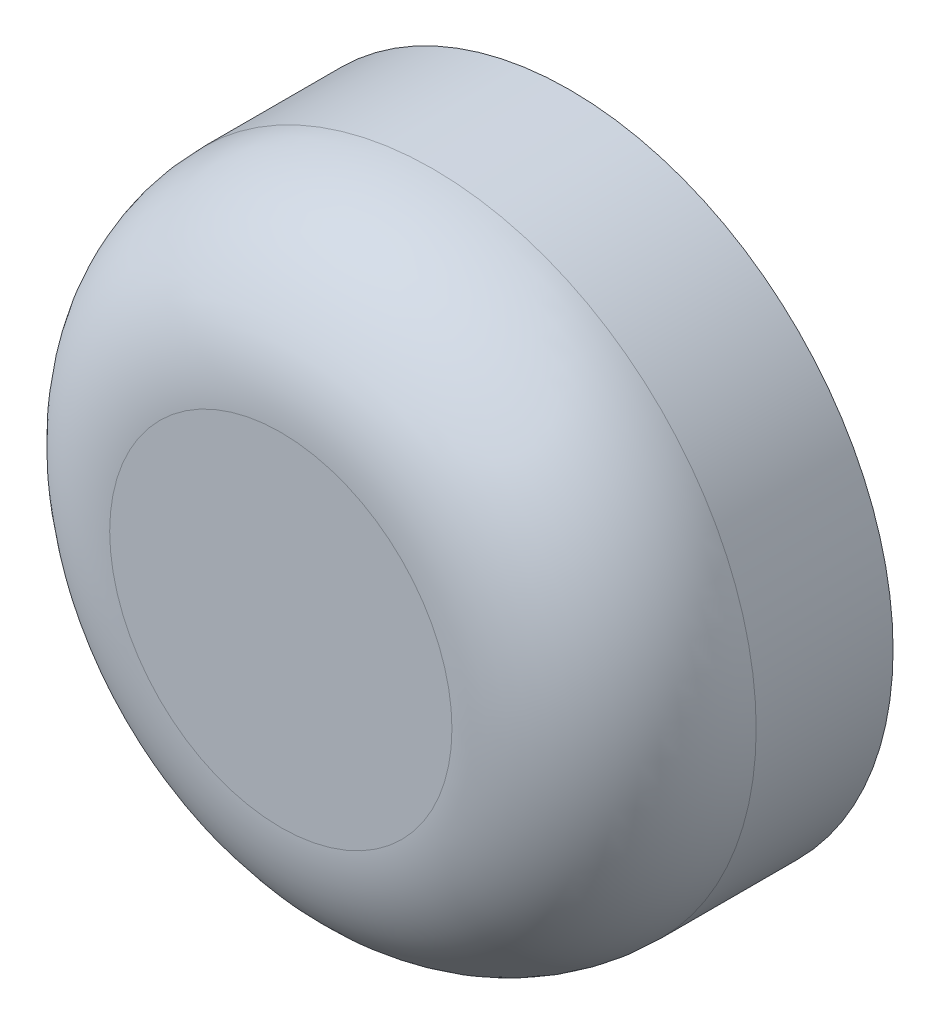
ISO-10303-21;
HEADER;
FILE_DESCRIPTION(('STEP AP214'),'2;1');
FILE_NAME('part.step','',(''),(''),'','','');
FILE_SCHEMA(('AUTOMOTIVE_DESIGN { 1 0 10303 214 1 1 1 1 }'));
ENDSEC;
DATA;
#1=APPLICATION_CONTEXT('core data for automotive mechanical design processes');
#2=APPLICATION_PROTOCOL_DEFINITION('international standard','automotive_design',2000,#1);
#3=PRODUCT_CONTEXT('',#1,'mechanical');
#4=PRODUCT('Part','Part','',(#3));
#5=PRODUCT_RELATED_PRODUCT_CATEGORY('part','',(#4));
#6=PRODUCT_DEFINITION_FORMATION('','',#4);
#7=PRODUCT_DEFINITION_CONTEXT('part definition',#1,'design');
#8=PRODUCT_DEFINITION('design','',#6,#7);
#9=PRODUCT_DEFINITION_SHAPE('','',#8);
#10=(LENGTH_UNIT() NAMED_UNIT(*) SI_UNIT(.MILLI.,.METRE.));
#11=(NAMED_UNIT(*) PLANE_ANGLE_UNIT() SI_UNIT($,.RADIAN.));
#12=(NAMED_UNIT(*) SI_UNIT($,.STERADIAN.) SOLID_ANGLE_UNIT());
#13=UNCERTAINTY_MEASURE_WITH_UNIT(LENGTH_MEASURE(1.E-05),#10,'distance_accuracy_value','');
#14=(GEOMETRIC_REPRESENTATION_CONTEXT(3) GLOBAL_UNCERTAINTY_ASSIGNED_CONTEXT((#13)) GLOBAL_UNIT_ASSIGNED_CONTEXT((#10,
#11,#12)) REPRESENTATION_CONTEXT('',''));
#15=CARTESIAN_POINT('',(0.,0.,0.));
#16=DIRECTION('',(0.,0.,1.));
#17=DIRECTION('',(1.,0.,0.));
#18=AXIS2_PLACEMENT_3D('',#15,#16,#17);
#19=CARTESIAN_POINT('',(0.,0.,0.));
#20=DIRECTION('',(0.,0.,1.));
#21=DIRECTION('',(1.,0.,0.));
#22=AXIS2_PLACEMENT_3D('',#19,#20,#21);
#23=PLANE('',#22);
#24=CARTESIAN_POINT('',(0.,0.,0.));
#25=DIRECTION('',(0.,0.,1.));
#26=DIRECTION('',(1.,0.,0.));
#27=AXIS2_PLACEMENT_3D('',#24,#25,#26);
#28=CIRCLE('',#27,4.25);
#29=CARTESIAN_POINT('',(4.25,0.,0.));
#30=VERTEX_POINT('',#29);
#31=EDGE_CURVE('E44',#30,#30,#28,.T.);
#32=ORIENTED_EDGE('',*,*,#31,.F.);
#33=EDGE_LOOP('',(#32));
#34=FACE_BOUND('',#33,.T.);
#35=CARTESIAN_POINT('',(0.,0.,0.));
#36=DIRECTION('',(0.,0.,1.));
#37=DIRECTION('',(1.,0.,0.));
#38=AXIS2_PLACEMENT_3D('',#35,#36,#37);
#39=CIRCLE('',#38,2.75);
#40=CARTESIAN_POINT('',(2.75,0.,0.));
#41=VERTEX_POINT('',#40);
#42=EDGE_CURVE('E48',#41,#41,#39,.T.);
#43=ORIENTED_EDGE('',*,*,#42,.T.);
#44=EDGE_LOOP('',(#43));
#45=FACE_BOUND('',#44,.T.);
#46=ADVANCED_FACE('F33',(#34,#45),#23,.F.);
#47=CARTESIAN_POINT('',(0.,0.,2.8));
#48=DIRECTION('',(0.,0.,-1.));
#49=DIRECTION('',(-1.,0.,0.));
#50=AXIS2_PLACEMENT_3D('',#47,#48,#49);
#51=CYLINDRICAL_SURFACE('',#50,4.25);
#52=CARTESIAN_POINT('',(0.,0.,1.8));
#53=DIRECTION('',(0.,0.,1.));
#54=DIRECTION('',(1.,0.,0.));
#55=AXIS2_PLACEMENT_3D('',#52,#53,#54);
#56=CIRCLE('',#55,4.25);
#57=CARTESIAN_POINT('',(4.25,0.,1.8));
#58=VERTEX_POINT('',#57);
#59=EDGE_CURVE('E10',#58,#58,#56,.F.);
#60=ORIENTED_EDGE('',*,*,#59,.T.);
#61=EDGE_LOOP('',(#60));
#62=FACE_BOUND('',#61,.T.);
#63=ORIENTED_EDGE('',*,*,#31,.T.);
#64=EDGE_LOOP('',(#63));
#65=FACE_BOUND('',#64,.T.);
#66=ADVANCED_FACE('F69',(#62,#65),#51,.T.);
#67=CARTESIAN_POINT('',(0.,0.,2.8));
#68=DIRECTION('',(0.,0.,-1.));
#69=DIRECTION('',(-1.,0.,0.));
#70=AXIS2_PLACEMENT_3D('',#67,#68,#69);
#71=CYLINDRICAL_SURFACE('',#70,2.75);
#72=CARTESIAN_POINT('',(0.,0.,2.8));
#73=DIRECTION('',(0.,0.,1.));
#74=DIRECTION('',(1.,0.,0.));
#75=AXIS2_PLACEMENT_3D('',#72,#73,#74);
#76=CIRCLE('',#75,2.75);
#77=CARTESIAN_POINT('',(2.75,0.,2.8));
#78=VERTEX_POINT('',#77);
#79=EDGE_CURVE('E53',#78,#78,#76,.T.);
#80=ORIENTED_EDGE('',*,*,#79,.T.);
#81=EDGE_LOOP('',(#80));
#82=FACE_BOUND('',#81,.T.);
#83=ORIENTED_EDGE('',*,*,#42,.F.);
#84=EDGE_LOOP('',(#83));
#85=FACE_BOUND('',#84,.T.);
#86=ADVANCED_FACE('F57',(#82,#85),#71,.F.);
#87=CARTESIAN_POINT('',(0.,0.,2.8));
#88=DIRECTION('',(0.,0.,1.));
#89=DIRECTION('',(1.,0.,0.));
#90=AXIS2_PLACEMENT_3D('',#87,#88,#89);
#91=PLANE('',#90);
#92=ORIENTED_EDGE('',*,*,#79,.F.);
#93=EDGE_LOOP('',(#92));
#94=FACE_BOUND('',#93,.T.);
#95=ADVANCED_FACE('F60',(#94),#91,.F.);
#96=CARTESIAN_POINT('',(0.,0.,3.8));
#97=DIRECTION('',(0.,0.,1.));
#98=DIRECTION('',(1.,0.,0.));
#99=AXIS2_PLACEMENT_3D('',#96,#97,#98);
#100=PLANE('',#99);
#101=CARTESIAN_POINT('',(0.,0.,3.8));
#102=DIRECTION('',(0.,0.,1.));
#103=DIRECTION('',(1.,0.,0.));
#104=AXIS2_PLACEMENT_3D('',#101,#102,#103);
#105=CIRCLE('',#104,2.25);
#106=CARTESIAN_POINT('',(2.25,0.,3.8));
#107=VERTEX_POINT('',#106);
#108=EDGE_CURVE('E40',#107,#107,#105,.T.);
#109=ORIENTED_EDGE('',*,*,#108,.T.);
#110=EDGE_LOOP('',(#109));
#111=FACE_BOUND('',#110,.T.);
#112=ADVANCED_FACE('F62',(#111),#100,.T.);
#113=CARTESIAN_POINT('',(0.,0.,1.8));
#114=DIRECTION('',(0.,0.,1.));
#115=DIRECTION('',(1.,0.,0.));
#116=AXIS2_PLACEMENT_3D('',#113,#114,#115);
#117=TOROIDAL_SURFACE('',#116,2.25,2.);
#118=ORIENTED_EDGE('',*,*,#59,.F.);
#119=EDGE_LOOP('',(#118));
#120=FACE_BOUND('',#119,.T.);
#121=ORIENTED_EDGE('',*,*,#108,.F.);
#122=EDGE_LOOP('',(#121));
#123=FACE_BOUND('',#122,.T.);
#124=ADVANCED_FACE('F35',(#120,#123),#117,.T.);
#125=CLOSED_SHELL('',(#46,#66,#86,#95,#112,#124));
#126=MANIFOLD_SOLID_BREP('B2',#125);
#127=ADVANCED_BREP_SHAPE_REPRESENTATION('',(#18,#126),#14);
#128=SHAPE_DEFINITION_REPRESENTATION(#9,#127);
ENDSEC;
END-ISO-10303-21;
